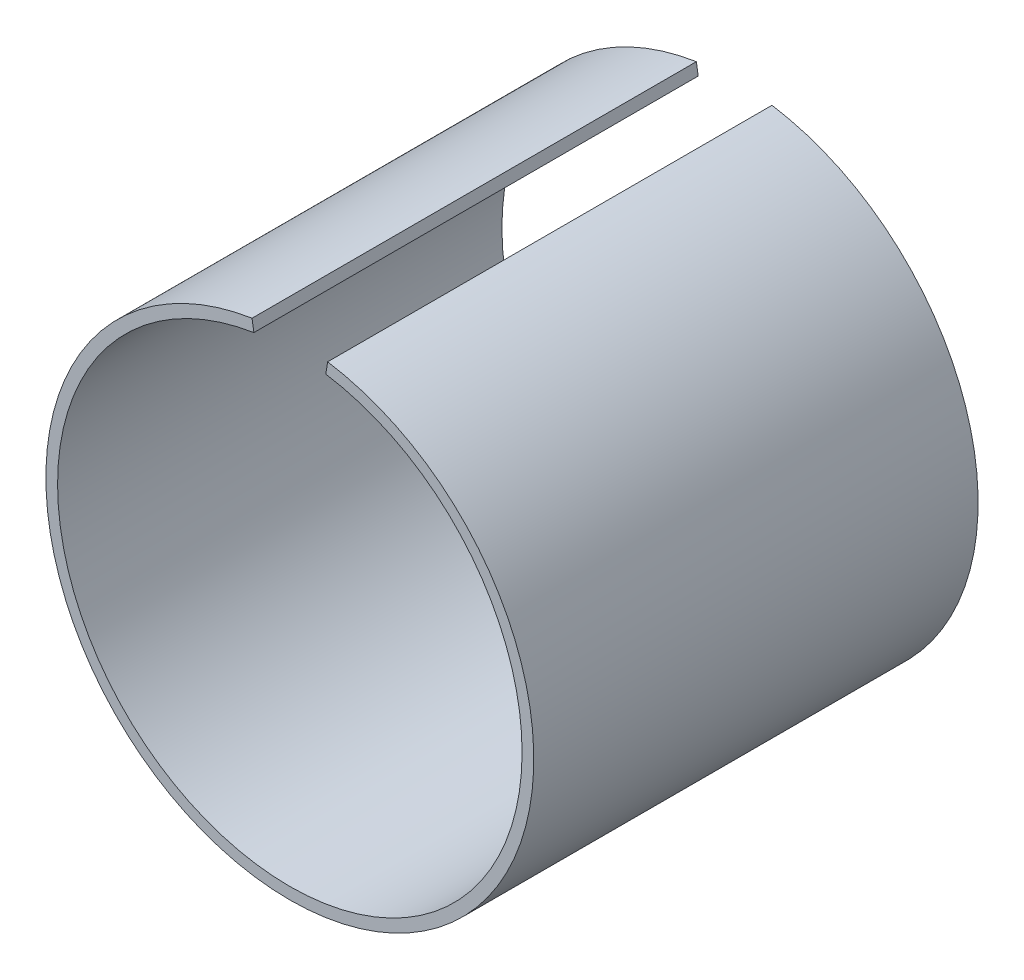
ISO-10303-21;
HEADER;
FILE_DESCRIPTION(('STEP AP214'),'2;1');
FILE_NAME('part.step','',(''),(''),'','','');
FILE_SCHEMA(('AUTOMOTIVE_DESIGN { 1 0 10303 214 1 1 1 1 }'));
ENDSEC;
DATA;
#1=APPLICATION_CONTEXT('core data for automotive mechanical design processes');
#2=APPLICATION_PROTOCOL_DEFINITION('international standard','automotive_design',2000,#1);
#3=PRODUCT_CONTEXT('',#1,'mechanical');
#4=PRODUCT('Part','Part','',(#3));
#5=PRODUCT_RELATED_PRODUCT_CATEGORY('part','',(#4));
#6=PRODUCT_DEFINITION_FORMATION('','',#4);
#7=PRODUCT_DEFINITION_CONTEXT('part definition',#1,'design');
#8=PRODUCT_DEFINITION('design','',#6,#7);
#9=PRODUCT_DEFINITION_SHAPE('','',#8);
#10=(LENGTH_UNIT() NAMED_UNIT(*) SI_UNIT(.MILLI.,.METRE.));
#11=(NAMED_UNIT(*) PLANE_ANGLE_UNIT() SI_UNIT($,.RADIAN.));
#12=(NAMED_UNIT(*) SI_UNIT($,.STERADIAN.) SOLID_ANGLE_UNIT());
#13=UNCERTAINTY_MEASURE_WITH_UNIT(LENGTH_MEASURE(1.E-05),#10,'distance_accuracy_value','');
#14=(GEOMETRIC_REPRESENTATION_CONTEXT(3) GLOBAL_UNCERTAINTY_ASSIGNED_CONTEXT((#13)) GLOBAL_UNIT_ASSIGNED_CONTEXT((#10,
#11,#12)) REPRESENTATION_CONTEXT('',''));
#15=CARTESIAN_POINT('',(0.,0.,0.));
#16=DIRECTION('',(0.,0.,1.));
#17=DIRECTION('',(1.,0.,0.));
#18=AXIS2_PLACEMENT_3D('',#15,#16,#17);
#19=CARTESIAN_POINT('',(0.,0.,0.));
#20=DIRECTION('',(0.,0.,1.));
#21=DIRECTION('',(1.,0.,0.));
#22=AXIS2_PLACEMENT_3D('',#19,#20,#21);
#23=PLANE('',#22);
#24=DIRECTION('',(-0.154901960784313,0.987929846975571,0.));
#25=VECTOR('',#24,1.);
#26=CARTESIAN_POINT('',(0.,0.,0.));
#27=LINE('',#26,#25);
#28=CARTESIAN_POINT('',(-2.765,17.6345477685139,0.));
#29=VERTEX_POINT('',#28);
#30=CARTESIAN_POINT('',(-2.90441176470588,18.523684630792,0.));
#31=VERTEX_POINT('',#30);
#32=EDGE_CURVE('E78',#29,#31,#27,.T.);
#33=ORIENTED_EDGE('',*,*,#32,.F.);
#34=CARTESIAN_POINT('',(0.,0.,0.));
#35=DIRECTION('',(0.,0.,1.));
#36=DIRECTION('',(1.,0.,0.));
#37=AXIS2_PLACEMENT_3D('',#34,#35,#36);
#38=CIRCLE('',#37,17.85);
#39=CARTESIAN_POINT('',(2.765,17.6345477685139,0.));
#40=VERTEX_POINT('',#39);
#41=EDGE_CURVE('E84',#29,#40,#38,.T.);
#42=ORIENTED_EDGE('',*,*,#41,.T.);
#43=DIRECTION('',(0.154901960784319,0.98792984697557,0.));
#44=VECTOR('',#43,1.);
#45=CARTESIAN_POINT('',(0.,0.,0.));
#46=LINE('',#45,#44);
#47=CARTESIAN_POINT('',(2.90441176470589,18.523684630792,0.));
#48=VERTEX_POINT('',#47);
#49=EDGE_CURVE('E21',#40,#48,#46,.T.);
#50=ORIENTED_EDGE('',*,*,#49,.T.);
#51=CARTESIAN_POINT('',(0.,0.,0.));
#52=DIRECTION('',(0.,0.,1.));
#53=DIRECTION('',(1.,0.,0.));
#54=AXIS2_PLACEMENT_3D('',#51,#52,#53);
#55=CIRCLE('',#54,18.75);
#56=EDGE_CURVE('E104',#31,#48,#55,.T.);
#57=ORIENTED_EDGE('',*,*,#56,.F.);
#58=EDGE_LOOP('',(#33,#42,#50,#57));
#59=FACE_BOUND('',#58,.T.);
#60=ADVANCED_FACE('F18',(#59),#23,.F.);
#61=CARTESIAN_POINT('',(0.,0.,34.15));
#62=DIRECTION('',(0.,0.,1.));
#63=DIRECTION('',(1.,0.,0.));
#64=AXIS2_PLACEMENT_3D('',#61,#62,#63);
#65=PLANE('',#64);
#66=DIRECTION('',(-0.154901960784313,0.987929846975571,0.));
#67=VECTOR('',#66,1.);
#68=CARTESIAN_POINT('',(0.,0.,34.15));
#69=LINE('',#68,#67);
#70=CARTESIAN_POINT('',(-2.765,17.6345477685139,34.15));
#71=VERTEX_POINT('',#70);
#72=CARTESIAN_POINT('',(-2.90441176470588,18.523684630792,34.15));
#73=VERTEX_POINT('',#72);
#74=EDGE_CURVE('E66',#71,#73,#69,.T.);
#75=ORIENTED_EDGE('',*,*,#74,.T.);
#76=CARTESIAN_POINT('',(0.,0.,34.15));
#77=DIRECTION('',(0.,0.,1.));
#78=DIRECTION('',(1.,0.,0.));
#79=AXIS2_PLACEMENT_3D('',#76,#77,#78);
#80=CIRCLE('',#79,18.75);
#81=CARTESIAN_POINT('',(2.90441176470589,18.523684630792,34.15));
#82=VERTEX_POINT('',#81);
#83=EDGE_CURVE('E86',#73,#82,#80,.T.);
#84=ORIENTED_EDGE('',*,*,#83,.T.);
#85=DIRECTION('',(0.154901960784319,0.98792984697557,0.));
#86=VECTOR('',#85,1.);
#87=CARTESIAN_POINT('',(0.,0.,34.15));
#88=LINE('',#87,#86);
#89=CARTESIAN_POINT('',(2.765,17.6345477685139,34.15));
#90=VERTEX_POINT('',#89);
#91=EDGE_CURVE('E11',#90,#82,#88,.T.);
#92=ORIENTED_EDGE('',*,*,#91,.F.);
#93=CARTESIAN_POINT('',(0.,0.,34.15));
#94=DIRECTION('',(0.,0.,1.));
#95=DIRECTION('',(1.,0.,0.));
#96=AXIS2_PLACEMENT_3D('',#93,#94,#95);
#97=CIRCLE('',#96,17.85);
#98=EDGE_CURVE('E83',#71,#90,#97,.T.);
#99=ORIENTED_EDGE('',*,*,#98,.F.);
#100=EDGE_LOOP('',(#75,#84,#92,#99));
#101=FACE_BOUND('',#100,.T.);
#102=ADVANCED_FACE('F88',(#101),#65,.T.);
#103=CARTESIAN_POINT('',(0.,0.,34.15));
#104=DIRECTION('',(-0.98792984697557,0.154901960784319,0.));
#105=DIRECTION('',(0.,0.,1.));
#106=AXIS2_PLACEMENT_3D('',#103,#104,#105);
#107=PLANE('',#106);
#108=ORIENTED_EDGE('',*,*,#49,.F.);
#109=DIRECTION('',(0.,0.,-1.));
#110=VECTOR('',#109,1.);
#111=CARTESIAN_POINT('',(2.765,17.6345477685139,34.15));
#112=LINE('',#111,#110);
#113=EDGE_CURVE('E91',#90,#40,#112,.T.);
#114=ORIENTED_EDGE('',*,*,#113,.F.);
#115=ORIENTED_EDGE('',*,*,#91,.T.);
#116=DIRECTION('',(0.,0.,-1.));
#117=VECTOR('',#116,1.);
#118=CARTESIAN_POINT('',(2.90441176470589,18.523684630792,34.15));
#119=LINE('',#118,#117);
#120=EDGE_CURVE('E108',#82,#48,#119,.T.);
#121=ORIENTED_EDGE('',*,*,#120,.T.);
#122=EDGE_LOOP('',(#108,#114,#115,#121));
#123=FACE_BOUND('',#122,.T.);
#124=ADVANCED_FACE('F117',(#123),#107,.T.);
#125=CARTESIAN_POINT('',(0.,0.,34.15));
#126=DIRECTION('',(-0.987929846975571,-0.154901960784313,0.));
#127=DIRECTION('',(-0.154901960784313,0.987929846975571,0.));
#128=AXIS2_PLACEMENT_3D('',#125,#126,#127);
#129=PLANE('',#128);
#130=ORIENTED_EDGE('',*,*,#32,.T.);
#131=DIRECTION('',(0.,0.,-1.));
#132=VECTOR('',#131,1.);
#133=CARTESIAN_POINT('',(-2.90441176470588,18.523684630792,34.15));
#134=LINE('',#133,#132);
#135=EDGE_CURVE('E72',#73,#31,#134,.T.);
#136=ORIENTED_EDGE('',*,*,#135,.F.);
#137=ORIENTED_EDGE('',*,*,#74,.F.);
#138=DIRECTION('',(0.,0.,-1.));
#139=VECTOR('',#138,1.);
#140=CARTESIAN_POINT('',(-2.765,17.6345477685139,34.15));
#141=LINE('',#140,#139);
#142=EDGE_CURVE('E69',#71,#29,#141,.T.);
#143=ORIENTED_EDGE('',*,*,#142,.T.);
#144=EDGE_LOOP('',(#130,#136,#137,#143));
#145=FACE_BOUND('',#144,.T.);
#146=ADVANCED_FACE('F68',(#145),#129,.F.);
#147=CARTESIAN_POINT('',(0.,0.,34.15));
#148=DIRECTION('',(0.,0.,-1.));
#149=DIRECTION('',(0.,-1.,0.));
#150=AXIS2_PLACEMENT_3D('',#147,#148,#149);
#151=CYLINDRICAL_SURFACE('',#150,18.75);
#152=ORIENTED_EDGE('',*,*,#83,.F.);
#153=ORIENTED_EDGE('',*,*,#135,.T.);
#154=ORIENTED_EDGE('',*,*,#56,.T.);
#155=ORIENTED_EDGE('',*,*,#120,.F.);
#156=EDGE_LOOP('',(#152,#153,#154,#155));
#157=FACE_BOUND('',#156,.T.);
#158=ADVANCED_FACE('F115',(#157),#151,.T.);
#159=CARTESIAN_POINT('',(0.,0.,34.15));
#160=DIRECTION('',(0.,0.,-1.));
#161=DIRECTION('',(0.,-1.,0.));
#162=AXIS2_PLACEMENT_3D('',#159,#160,#161);
#163=CYLINDRICAL_SURFACE('',#162,17.85);
#164=ORIENTED_EDGE('',*,*,#98,.T.);
#165=ORIENTED_EDGE('',*,*,#113,.T.);
#166=ORIENTED_EDGE('',*,*,#41,.F.);
#167=ORIENTED_EDGE('',*,*,#142,.F.);
#168=EDGE_LOOP('',(#164,#165,#166,#167));
#169=FACE_BOUND('',#168,.T.);
#170=ADVANCED_FACE('F81',(#169),#163,.F.);
#171=CLOSED_SHELL('',(#60,#102,#124,#146,#158,#170));
#172=MANIFOLD_SOLID_BREP('B1',#171);
#173=ADVANCED_BREP_SHAPE_REPRESENTATION('',(#18,#172),#14);
#174=SHAPE_DEFINITION_REPRESENTATION(#9,#173);
ENDSEC;
END-ISO-10303-21;
